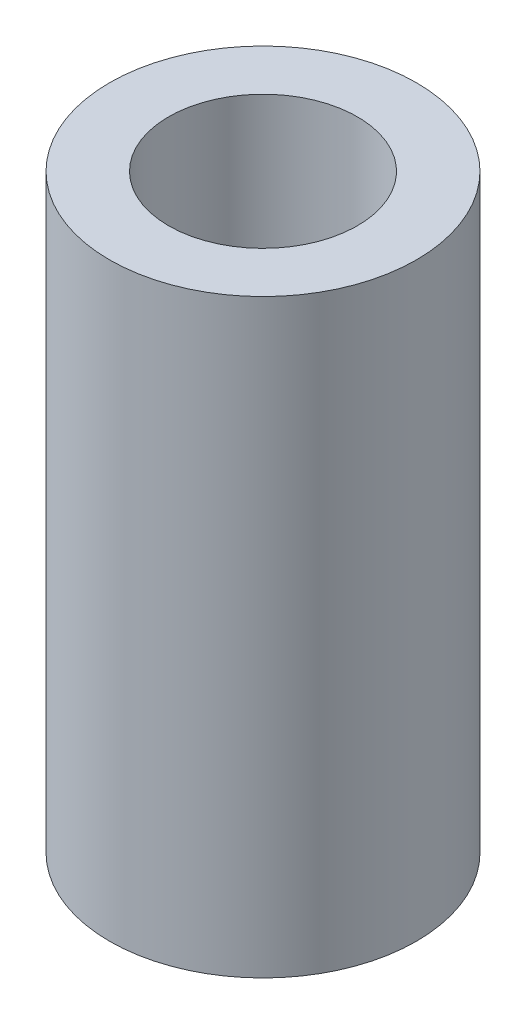
ISO-10303-21;
HEADER;
FILE_DESCRIPTION(('STEP AP214'),'2;1');
FILE_NAME('part.step','',(''),(''),'','','');
FILE_SCHEMA(('AUTOMOTIVE_DESIGN { 1 0 10303 214 1 1 1 1 }'));
ENDSEC;
DATA;
#1=APPLICATION_CONTEXT('core data for automotive mechanical design processes');
#2=APPLICATION_PROTOCOL_DEFINITION('international standard','automotive_design',2000,#1);
#3=PRODUCT_CONTEXT('',#1,'mechanical');
#4=PRODUCT('Part','Part','',(#3));
#5=PRODUCT_RELATED_PRODUCT_CATEGORY('part','',(#4));
#6=PRODUCT_DEFINITION_FORMATION('','',#4);
#7=PRODUCT_DEFINITION_CONTEXT('part definition',#1,'design');
#8=PRODUCT_DEFINITION('design','',#6,#7);
#9=PRODUCT_DEFINITION_SHAPE('','',#8);
#10=(LENGTH_UNIT() NAMED_UNIT(*) SI_UNIT(.MILLI.,.METRE.));
#11=(NAMED_UNIT(*) PLANE_ANGLE_UNIT() SI_UNIT($,.RADIAN.));
#12=(NAMED_UNIT(*) SI_UNIT($,.STERADIAN.) SOLID_ANGLE_UNIT());
#13=UNCERTAINTY_MEASURE_WITH_UNIT(LENGTH_MEASURE(1.E-05),#10,'distance_accuracy_value','');
#14=(GEOMETRIC_REPRESENTATION_CONTEXT(3) GLOBAL_UNCERTAINTY_ASSIGNED_CONTEXT((#13)) GLOBAL_UNIT_ASSIGNED_CONTEXT((#10,
#11,#12)) REPRESENTATION_CONTEXT('',''));
#15=CARTESIAN_POINT('',(0.,0.,0.));
#16=DIRECTION('',(0.,0.,1.));
#17=DIRECTION('',(1.,0.,0.));
#18=AXIS2_PLACEMENT_3D('',#15,#16,#17);
#19=CARTESIAN_POINT('',(0.,10.,0.));
#20=DIRECTION('',(0.,1.,0.));
#21=DIRECTION('',(0.,0.,1.));
#22=AXIS2_PLACEMENT_3D('',#19,#20,#21);
#23=PLANE('',#22);
#24=CARTESIAN_POINT('',(0.,10.,0.));
#25=DIRECTION('',(0.,1.,0.));
#26=DIRECTION('',(0.,0.,1.));
#27=AXIS2_PLACEMENT_3D('',#24,#25,#26);
#28=CIRCLE('',#27,2.6);
#29=CARTESIAN_POINT('',(0.,10.,2.6));
#30=VERTEX_POINT('',#29);
#31=EDGE_CURVE('E10',#30,#30,#28,.T.);
#32=ORIENTED_EDGE('',*,*,#31,.T.);
#33=EDGE_LOOP('',(#32));
#34=FACE_BOUND('',#33,.T.);
#35=CARTESIAN_POINT('',(0.,10.,0.));
#36=DIRECTION('',(0.,1.,0.));
#37=DIRECTION('',(0.,0.,1.));
#38=AXIS2_PLACEMENT_3D('',#35,#36,#37);
#39=CIRCLE('',#38,1.6);
#40=CARTESIAN_POINT('',(0.,10.,1.6));
#41=VERTEX_POINT('',#40);
#42=EDGE_CURVE('E50',#41,#41,#39,.T.);
#43=ORIENTED_EDGE('',*,*,#42,.F.);
#44=EDGE_LOOP('',(#43));
#45=FACE_BOUND('',#44,.T.);
#46=ADVANCED_FACE('F37',(#34,#45),#23,.T.);
#47=CARTESIAN_POINT('',(0.,0.,0.));
#48=DIRECTION('',(0.,1.,0.));
#49=DIRECTION('',(0.,0.,1.));
#50=AXIS2_PLACEMENT_3D('',#47,#48,#49);
#51=PLANE('',#50);
#52=CARTESIAN_POINT('',(0.,0.,0.));
#53=DIRECTION('',(0.,1.,0.));
#54=DIRECTION('',(0.,0.,1.));
#55=AXIS2_PLACEMENT_3D('',#52,#53,#54);
#56=CIRCLE('',#55,2.6);
#57=CARTESIAN_POINT('',(0.,0.,2.6));
#58=VERTEX_POINT('',#57);
#59=EDGE_CURVE('E41',#58,#58,#56,.T.);
#60=ORIENTED_EDGE('',*,*,#59,.F.);
#61=EDGE_LOOP('',(#60));
#62=FACE_BOUND('',#61,.T.);
#63=CARTESIAN_POINT('',(0.,0.,0.));
#64=DIRECTION('',(0.,1.,0.));
#65=DIRECTION('',(0.,0.,1.));
#66=AXIS2_PLACEMENT_3D('',#63,#64,#65);
#67=CIRCLE('',#66,1.6);
#68=CARTESIAN_POINT('',(0.,0.,1.6));
#69=VERTEX_POINT('',#68);
#70=EDGE_CURVE('E52',#69,#69,#67,.T.);
#71=ORIENTED_EDGE('',*,*,#70,.T.);
#72=EDGE_LOOP('',(#71));
#73=FACE_BOUND('',#72,.T.);
#74=ADVANCED_FACE('F64',(#62,#73),#51,.F.);
#75=CARTESIAN_POINT('',(0.,10.,0.));
#76=DIRECTION('',(0.,-1.,0.));
#77=DIRECTION('',(0.,0.,-1.));
#78=AXIS2_PLACEMENT_3D('',#75,#76,#77);
#79=CYLINDRICAL_SURFACE('',#78,2.6);
#80=ORIENTED_EDGE('',*,*,#31,.F.);
#81=EDGE_LOOP('',(#80));
#82=FACE_BOUND('',#81,.T.);
#83=ORIENTED_EDGE('',*,*,#59,.T.);
#84=EDGE_LOOP('',(#83));
#85=FACE_BOUND('',#84,.T.);
#86=ADVANCED_FACE('F39',(#82,#85),#79,.T.);
#87=CARTESIAN_POINT('',(0.,10.,0.));
#88=DIRECTION('',(0.,-1.,0.));
#89=DIRECTION('',(0.,0.,-1.));
#90=AXIS2_PLACEMENT_3D('',#87,#88,#89);
#91=CYLINDRICAL_SURFACE('',#90,1.6);
#92=ORIENTED_EDGE('',*,*,#42,.T.);
#93=EDGE_LOOP('',(#92));
#94=FACE_BOUND('',#93,.T.);
#95=ORIENTED_EDGE('',*,*,#70,.F.);
#96=EDGE_LOOP('',(#95));
#97=FACE_BOUND('',#96,.T.);
#98=ADVANCED_FACE('F60',(#94,#97),#91,.F.);
#99=CLOSED_SHELL('',(#46,#74,#86,#98));
#100=MANIFOLD_SOLID_BREP('B2',#99);
#101=ADVANCED_BREP_SHAPE_REPRESENTATION('',(#18,#100),#14);
#102=SHAPE_DEFINITION_REPRESENTATION(#9,#101);
ENDSEC;
END-ISO-10303-21;
